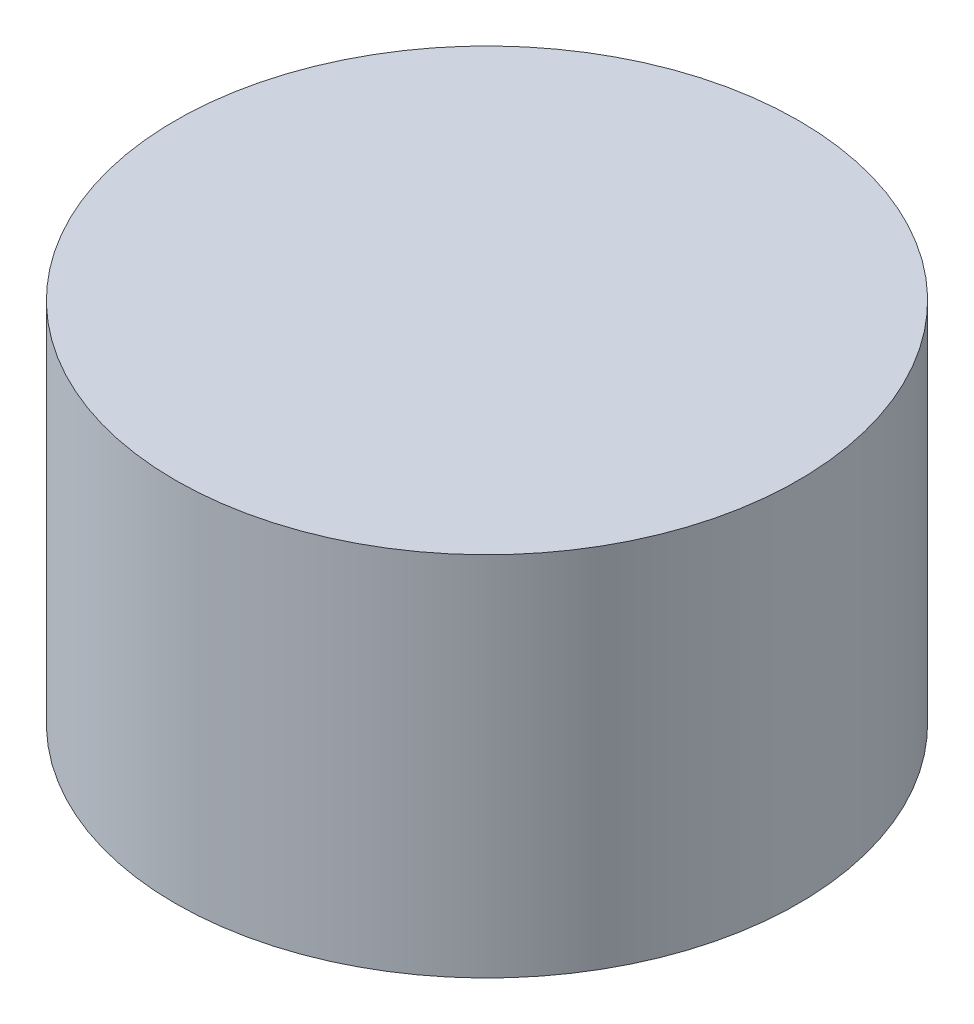
ISO-10303-21;
HEADER;
FILE_DESCRIPTION(('STEP AP214'),'2;1');
FILE_NAME('part.step','',(''),(''),'','','');
FILE_SCHEMA(('AUTOMOTIVE_DESIGN { 1 0 10303 214 1 1 1 1 }'));
ENDSEC;
DATA;
#1=APPLICATION_CONTEXT('core data for automotive mechanical design processes');
#2=APPLICATION_PROTOCOL_DEFINITION('international standard','automotive_design',2000,#1);
#3=PRODUCT_CONTEXT('',#1,'mechanical');
#4=PRODUCT('Part','Part','',(#3));
#5=PRODUCT_RELATED_PRODUCT_CATEGORY('part','',(#4));
#6=PRODUCT_DEFINITION_FORMATION('','',#4);
#7=PRODUCT_DEFINITION_CONTEXT('part definition',#1,'design');
#8=PRODUCT_DEFINITION('design','',#6,#7);
#9=PRODUCT_DEFINITION_SHAPE('','',#8);
#10=(LENGTH_UNIT() NAMED_UNIT(*) SI_UNIT(.MILLI.,.METRE.));
#11=(NAMED_UNIT(*) PLANE_ANGLE_UNIT() SI_UNIT($,.RADIAN.));
#12=(NAMED_UNIT(*) SI_UNIT($,.STERADIAN.) SOLID_ANGLE_UNIT());
#13=UNCERTAINTY_MEASURE_WITH_UNIT(LENGTH_MEASURE(1.E-05),#10,'distance_accuracy_value','');
#14=(GEOMETRIC_REPRESENTATION_CONTEXT(3) GLOBAL_UNCERTAINTY_ASSIGNED_CONTEXT((#13)) GLOBAL_UNIT_ASSIGNED_CONTEXT((#10,
#11,#12)) REPRESENTATION_CONTEXT('',''));
#15=CARTESIAN_POINT('',(0.,0.,0.));
#16=DIRECTION('',(0.,0.,1.));
#17=DIRECTION('',(1.,0.,0.));
#18=AXIS2_PLACEMENT_3D('',#15,#16,#17);
#19=CARTESIAN_POINT('',(-2.57302092903335,10.,-1.57428254210593));
#20=DIRECTION('',(0.,-1.,0.));
#21=DIRECTION('',(0.,0.,-1.));
#22=AXIS2_PLACEMENT_3D('',#19,#20,#21);
#23=CYLINDRICAL_SURFACE('',#22,8.5);
#24=CARTESIAN_POINT('',(-2.57302092903335,10.,-1.57428254210593));
#25=DIRECTION('',(0.,1.,0.));
#26=DIRECTION('',(0.,0.,1.));
#27=AXIS2_PLACEMENT_3D('',#24,#25,#26);
#28=CIRCLE('',#27,8.5);
#29=CARTESIAN_POINT('',(-2.57302092903335,10.,6.92571745789407));
#30=VERTEX_POINT('',#29);
#31=EDGE_CURVE('E10',#30,#30,#28,.T.);
#32=ORIENTED_EDGE('',*,*,#31,.F.);
#33=EDGE_LOOP('',(#32));
#34=FACE_BOUND('',#33,.T.);
#35=CARTESIAN_POINT('',(-2.57302092903335,0.,-1.57428254210593));
#36=DIRECTION('',(0.,1.,0.));
#37=DIRECTION('',(0.,0.,1.));
#38=AXIS2_PLACEMENT_3D('',#35,#36,#37);
#39=CIRCLE('',#38,8.5);
#40=CARTESIAN_POINT('',(-2.57302092903335,0.,6.92571745789407));
#41=VERTEX_POINT('',#40);
#42=EDGE_CURVE('E34',#41,#41,#39,.T.);
#43=ORIENTED_EDGE('',*,*,#42,.T.);
#44=EDGE_LOOP('',(#43));
#45=FACE_BOUND('',#44,.T.);
#46=ADVANCED_FACE('F31',(#34,#45),#23,.T.);
#47=CARTESIAN_POINT('',(-2.57302092903335,10.,-1.57428254210593));
#48=DIRECTION('',(0.,1.,0.));
#49=DIRECTION('',(0.,0.,1.));
#50=AXIS2_PLACEMENT_3D('',#47,#48,#49);
#51=PLANE('',#50);
#52=ORIENTED_EDGE('',*,*,#31,.T.);
#53=EDGE_LOOP('',(#52));
#54=FACE_BOUND('',#53,.T.);
#55=ADVANCED_FACE('F46',(#54),#51,.T.);
#56=CARTESIAN_POINT('',(-2.57302092903335,0.,-1.57428254210593));
#57=DIRECTION('',(0.,1.,0.));
#58=DIRECTION('',(0.,0.,1.));
#59=AXIS2_PLACEMENT_3D('',#56,#57,#58);
#60=PLANE('',#59);
#61=ORIENTED_EDGE('',*,*,#42,.F.);
#62=EDGE_LOOP('',(#61));
#63=FACE_BOUND('',#62,.T.);
#64=ADVANCED_FACE('F44',(#63),#60,.F.);
#65=CLOSED_SHELL('',(#46,#55,#64));
#66=MANIFOLD_SOLID_BREP('B2',#65);
#67=ADVANCED_BREP_SHAPE_REPRESENTATION('',(#18,#66),#14);
#68=SHAPE_DEFINITION_REPRESENTATION(#9,#67);
ENDSEC;
END-ISO-10303-21;
